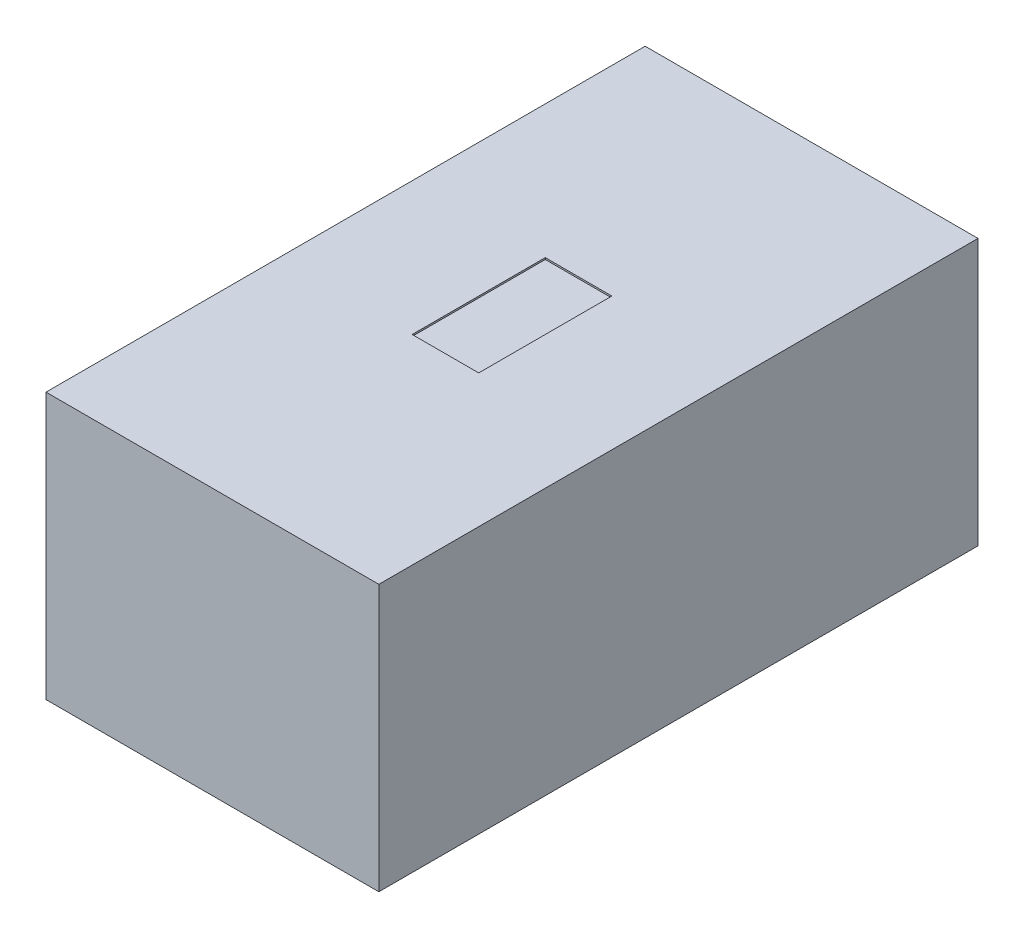
ISO-10303-21;
HEADER;
FILE_DESCRIPTION(('STEP AP214'),'2;1');
FILE_NAME('part.step','',(''),(''),'','','');
FILE_SCHEMA(('AUTOMOTIVE_DESIGN { 1 0 10303 214 1 1 1 1 }'));
ENDSEC;
DATA;
#1=APPLICATION_CONTEXT('core data for automotive mechanical design processes');
#2=APPLICATION_PROTOCOL_DEFINITION('international standard','automotive_design',2000,#1);
#3=PRODUCT_CONTEXT('',#1,'mechanical');
#4=PRODUCT('Part','Part','',(#3));
#5=PRODUCT_RELATED_PRODUCT_CATEGORY('part','',(#4));
#6=PRODUCT_DEFINITION_FORMATION('','',#4);
#7=PRODUCT_DEFINITION_CONTEXT('part definition',#1,'design');
#8=PRODUCT_DEFINITION('design','',#6,#7);
#9=PRODUCT_DEFINITION_SHAPE('','',#8);
#10=(LENGTH_UNIT() NAMED_UNIT(*) SI_UNIT(.MILLI.,.METRE.));
#11=(NAMED_UNIT(*) PLANE_ANGLE_UNIT() SI_UNIT($,.RADIAN.));
#12=(NAMED_UNIT(*) SI_UNIT($,.STERADIAN.) SOLID_ANGLE_UNIT());
#13=UNCERTAINTY_MEASURE_WITH_UNIT(LENGTH_MEASURE(1.E-05),#10,'distance_accuracy_value','');
#14=(GEOMETRIC_REPRESENTATION_CONTEXT(3) GLOBAL_UNCERTAINTY_ASSIGNED_CONTEXT((#13)) GLOBAL_UNIT_ASSIGNED_CONTEXT((#10,
#11,#12)) REPRESENTATION_CONTEXT('',''));
#15=CARTESIAN_POINT('',(0.,0.,0.));
#16=DIRECTION('',(0.,0.,1.));
#17=DIRECTION('',(1.,0.,0.));
#18=AXIS2_PLACEMENT_3D('',#15,#16,#17);
#19=CARTESIAN_POINT('',(0.5,0.8,-0.9));
#20=DIRECTION('',(-1.,0.,0.));
#21=DIRECTION('',(0.,0.,1.));
#22=AXIS2_PLACEMENT_3D('',#19,#20,#21);
#23=PLANE('',#22);
#24=DIRECTION('',(0.,0.,-1.));
#25=VECTOR('',#24,1.);
#26=CARTESIAN_POINT('',(0.5,0.,-0.9));
#27=LINE('',#26,#25);
#28=CARTESIAN_POINT('',(0.5,0.,0.9));
#29=VERTEX_POINT('',#28);
#30=CARTESIAN_POINT('',(0.5,0.,-0.9));
#31=VERTEX_POINT('',#30);
#32=EDGE_CURVE('E140',#29,#31,#27,.T.);
#33=ORIENTED_EDGE('',*,*,#32,.T.);
#34=DIRECTION('',(0.,-1.,0.));
#35=VECTOR('',#34,1.);
#36=CARTESIAN_POINT('',(0.5,0.8,-0.9));
#37=LINE('',#36,#35);
#38=CARTESIAN_POINT('',(0.5,0.8,-0.9));
#39=VERTEX_POINT('',#38);
#40=EDGE_CURVE('E11',#39,#31,#37,.T.);
#41=ORIENTED_EDGE('',*,*,#40,.F.);
#42=DIRECTION('',(0.,0.,-1.));
#43=VECTOR('',#42,1.);
#44=CARTESIAN_POINT('',(0.5,0.8,-0.9));
#45=LINE('',#44,#43);
#46=CARTESIAN_POINT('',(0.5,0.8,0.9));
#47=VERTEX_POINT('',#46);
#48=EDGE_CURVE('E144',#47,#39,#45,.T.);
#49=ORIENTED_EDGE('',*,*,#48,.F.);
#50=DIRECTION('',(0.,-1.,0.));
#51=VECTOR('',#50,1.);
#52=CARTESIAN_POINT('',(0.5,0.8,0.9));
#53=LINE('',#52,#51);
#54=EDGE_CURVE('E150',#47,#29,#53,.T.);
#55=ORIENTED_EDGE('',*,*,#54,.T.);
#56=EDGE_LOOP('',(#33,#41,#49,#55));
#57=FACE_BOUND('',#56,.T.);
#58=ADVANCED_FACE('F32',(#57),#23,.F.);
#59=CARTESIAN_POINT('',(-0.5,0.8,-0.9));
#60=DIRECTION('',(0.,0.,1.));
#61=DIRECTION('',(1.,0.,0.));
#62=AXIS2_PLACEMENT_3D('',#59,#60,#61);
#63=PLANE('',#62);
#64=DIRECTION('',(-1.,0.,0.));
#65=VECTOR('',#64,1.);
#66=CARTESIAN_POINT('',(-0.5,0.,-0.9));
#67=LINE('',#66,#65);
#68=CARTESIAN_POINT('',(-0.5,0.,-0.9));
#69=VERTEX_POINT('',#68);
#70=EDGE_CURVE('E153',#31,#69,#67,.T.);
#71=ORIENTED_EDGE('',*,*,#70,.T.);
#72=DIRECTION('',(0.,-1.,0.));
#73=VECTOR('',#72,1.);
#74=CARTESIAN_POINT('',(-0.5,0.8,-0.9));
#75=LINE('',#74,#73);
#76=CARTESIAN_POINT('',(-0.5,0.8,-0.9));
#77=VERTEX_POINT('',#76);
#78=EDGE_CURVE('E39',#77,#69,#75,.T.);
#79=ORIENTED_EDGE('',*,*,#78,.F.);
#80=DIRECTION('',(-1.,0.,0.));
#81=VECTOR('',#80,1.);
#82=CARTESIAN_POINT('',(-0.5,0.8,-0.9));
#83=LINE('',#82,#81);
#84=EDGE_CURVE('E83',#39,#77,#83,.T.);
#85=ORIENTED_EDGE('',*,*,#84,.F.);
#86=ORIENTED_EDGE('',*,*,#40,.T.);
#87=EDGE_LOOP('',(#71,#79,#85,#86));
#88=FACE_BOUND('',#87,.T.);
#89=ADVANCED_FACE('F182',(#88),#63,.F.);
#90=CARTESIAN_POINT('',(-0.5,0.8,-0.9));
#91=DIRECTION('',(1.,0.,0.));
#92=DIRECTION('',(0.,0.,-1.));
#93=AXIS2_PLACEMENT_3D('',#90,#91,#92);
#94=PLANE('',#93);
#95=DIRECTION('',(0.,0.,1.));
#96=VECTOR('',#95,1.);
#97=CARTESIAN_POINT('',(-0.5,0.,-0.9));
#98=LINE('',#97,#96);
#99=CARTESIAN_POINT('',(-0.5,0.,0.9));
#100=VERTEX_POINT('',#99);
#101=EDGE_CURVE('E155',#69,#100,#98,.T.);
#102=ORIENTED_EDGE('',*,*,#101,.T.);
#103=DIRECTION('',(0.,-1.,0.));
#104=VECTOR('',#103,1.);
#105=CARTESIAN_POINT('',(-0.5,0.8,0.9));
#106=LINE('',#105,#104);
#107=CARTESIAN_POINT('',(-0.5,0.8,0.9));
#108=VERTEX_POINT('',#107);
#109=EDGE_CURVE('E159',#108,#100,#106,.T.);
#110=ORIENTED_EDGE('',*,*,#109,.F.);
#111=DIRECTION('',(0.,0.,1.));
#112=VECTOR('',#111,1.);
#113=CARTESIAN_POINT('',(-0.5,0.8,-0.9));
#114=LINE('',#113,#112);
#115=EDGE_CURVE('E147',#77,#108,#114,.T.);
#116=ORIENTED_EDGE('',*,*,#115,.F.);
#117=ORIENTED_EDGE('',*,*,#78,.T.);
#118=EDGE_LOOP('',(#102,#110,#116,#117));
#119=FACE_BOUND('',#118,.T.);
#120=ADVANCED_FACE('F164',(#119),#94,.F.);
#121=CARTESIAN_POINT('',(-0.5,0.8,0.9));
#122=DIRECTION('',(0.,0.,-1.));
#123=DIRECTION('',(-1.,0.,0.));
#124=AXIS2_PLACEMENT_3D('',#121,#122,#123);
#125=PLANE('',#124);
#126=DIRECTION('',(1.,0.,0.));
#127=VECTOR('',#126,1.);
#128=CARTESIAN_POINT('',(-0.5,0.,0.9));
#129=LINE('',#128,#127);
#130=EDGE_CURVE('E76',#100,#29,#129,.T.);
#131=ORIENTED_EDGE('',*,*,#130,.T.);
#132=ORIENTED_EDGE('',*,*,#54,.F.);
#133=DIRECTION('',(1.,0.,0.));
#134=VECTOR('',#133,1.);
#135=CARTESIAN_POINT('',(-0.5,0.8,0.9));
#136=LINE('',#135,#134);
#137=EDGE_CURVE('E55',#108,#47,#136,.T.);
#138=ORIENTED_EDGE('',*,*,#137,.F.);
#139=ORIENTED_EDGE('',*,*,#109,.T.);
#140=EDGE_LOOP('',(#131,#132,#138,#139));
#141=FACE_BOUND('',#140,.T.);
#142=ADVANCED_FACE('F172',(#141),#125,.F.);
#143=CARTESIAN_POINT('',(0.,0.8,0.));
#144=DIRECTION('',(0.,1.,0.));
#145=DIRECTION('',(0.,0.,1.));
#146=AXIS2_PLACEMENT_3D('',#143,#144,#145);
#147=PLANE('',#146);
#148=DIRECTION('',(0.,0.,-1.));
#149=VECTOR('',#148,1.);
#150=CARTESIAN_POINT('',(0.1,0.8,-0.2));
#151=LINE('',#150,#149);
#152=CARTESIAN_POINT('',(0.1,0.8,0.2));
#153=VERTEX_POINT('',#152);
#154=CARTESIAN_POINT('',(0.1,0.8,-0.2));
#155=VERTEX_POINT('',#154);
#156=EDGE_CURVE('E46',#153,#155,#151,.T.);
#157=ORIENTED_EDGE('',*,*,#156,.F.);
#158=DIRECTION('',(1.,0.,0.));
#159=VECTOR('',#158,1.);
#160=CARTESIAN_POINT('',(-0.1,0.8,0.2));
#161=LINE('',#160,#159);
#162=CARTESIAN_POINT('',(-0.1,0.8,0.2));
#163=VERTEX_POINT('',#162);
#164=EDGE_CURVE('E125',#163,#153,#161,.T.);
#165=ORIENTED_EDGE('',*,*,#164,.F.);
#166=DIRECTION('',(0.,0.,1.));
#167=VECTOR('',#166,1.);
#168=CARTESIAN_POINT('',(-0.1,0.8,-0.2));
#169=LINE('',#168,#167);
#170=CARTESIAN_POINT('',(-0.1,0.8,-0.2));
#171=VERTEX_POINT('',#170);
#172=EDGE_CURVE('E128',#171,#163,#169,.T.);
#173=ORIENTED_EDGE('',*,*,#172,.F.);
#174=DIRECTION('',(-1.,0.,0.));
#175=VECTOR('',#174,1.);
#176=CARTESIAN_POINT('',(-0.1,0.8,-0.2));
#177=LINE('',#176,#175);
#178=EDGE_CURVE('E134',#155,#171,#177,.T.);
#179=ORIENTED_EDGE('',*,*,#178,.F.);
#180=EDGE_LOOP('',(#157,#165,#173,#179));
#181=FACE_BOUND('',#180,.T.);
#182=ORIENTED_EDGE('',*,*,#48,.T.);
#183=ORIENTED_EDGE('',*,*,#84,.T.);
#184=ORIENTED_EDGE('',*,*,#115,.T.);
#185=ORIENTED_EDGE('',*,*,#137,.T.);
#186=EDGE_LOOP('',(#182,#183,#184,#185));
#187=FACE_BOUND('',#186,.T.);
#188=ADVANCED_FACE('F174',(#181,#187),#147,.T.);
#189=CARTESIAN_POINT('',(0.,0.,0.));
#190=DIRECTION('',(0.,1.,0.));
#191=DIRECTION('',(0.,0.,1.));
#192=AXIS2_PLACEMENT_3D('',#189,#190,#191);
#193=PLANE('',#192);
#194=ORIENTED_EDGE('',*,*,#32,.F.);
#195=ORIENTED_EDGE('',*,*,#130,.F.);
#196=ORIENTED_EDGE('',*,*,#101,.F.);
#197=ORIENTED_EDGE('',*,*,#70,.F.);
#198=EDGE_LOOP('',(#194,#195,#196,#197));
#199=FACE_BOUND('',#198,.T.);
#200=ADVANCED_FACE('F168',(#199),#193,.F.);
#201=CARTESIAN_POINT('',(0.1,0.795,-0.2));
#202=DIRECTION('',(1.,0.,0.));
#203=DIRECTION('',(0.,0.,-1.));
#204=AXIS2_PLACEMENT_3D('',#201,#202,#203);
#205=PLANE('',#204);
#206=ORIENTED_EDGE('',*,*,#156,.T.);
#207=DIRECTION('',(0.,1.,0.));
#208=VECTOR('',#207,1.);
#209=CARTESIAN_POINT('',(0.1,0.795,-0.2));
#210=LINE('',#209,#208);
#211=CARTESIAN_POINT('',(0.1,0.795,-0.2));
#212=VERTEX_POINT('',#211);
#213=EDGE_CURVE('E103',#212,#155,#210,.T.);
#214=ORIENTED_EDGE('',*,*,#213,.F.);
#215=DIRECTION('',(0.,0.,-1.));
#216=VECTOR('',#215,1.);
#217=CARTESIAN_POINT('',(0.1,0.795,-0.2));
#218=LINE('',#217,#216);
#219=CARTESIAN_POINT('',(0.1,0.795,0.2));
#220=VERTEX_POINT('',#219);
#221=EDGE_CURVE('E107',#220,#212,#218,.T.);
#222=ORIENTED_EDGE('',*,*,#221,.F.);
#223=DIRECTION('',(0.,1.,0.));
#224=VECTOR('',#223,1.);
#225=CARTESIAN_POINT('',(0.1,0.795,0.2));
#226=LINE('',#225,#224);
#227=EDGE_CURVE('E138',#220,#153,#226,.T.);
#228=ORIENTED_EDGE('',*,*,#227,.T.);
#229=EDGE_LOOP('',(#206,#214,#222,#228));
#230=FACE_BOUND('',#229,.T.);
#231=ADVANCED_FACE('F105',(#230),#205,.F.);
#232=CARTESIAN_POINT('',(-0.1,0.795,0.2));
#233=DIRECTION('',(0.,0.,1.));
#234=DIRECTION('',(1.,0.,0.));
#235=AXIS2_PLACEMENT_3D('',#232,#233,#234);
#236=PLANE('',#235);
#237=ORIENTED_EDGE('',*,*,#164,.T.);
#238=ORIENTED_EDGE('',*,*,#227,.F.);
#239=DIRECTION('',(1.,0.,0.));
#240=VECTOR('',#239,1.);
#241=CARTESIAN_POINT('',(-0.1,0.795,0.2));
#242=LINE('',#241,#240);
#243=CARTESIAN_POINT('',(-0.1,0.795,0.2));
#244=VERTEX_POINT('',#243);
#245=EDGE_CURVE('E113',#244,#220,#242,.T.);
#246=ORIENTED_EDGE('',*,*,#245,.F.);
#247=DIRECTION('',(0.,1.,0.));
#248=VECTOR('',#247,1.);
#249=CARTESIAN_POINT('',(-0.1,0.795,0.2));
#250=LINE('',#249,#248);
#251=EDGE_CURVE('E141',#244,#163,#250,.T.);
#252=ORIENTED_EDGE('',*,*,#251,.T.);
#253=EDGE_LOOP('',(#237,#238,#246,#252));
#254=FACE_BOUND('',#253,.T.);
#255=ADVANCED_FACE('F221',(#254),#236,.F.);
#256=CARTESIAN_POINT('',(-0.1,0.795,-0.2));
#257=DIRECTION('',(-1.,0.,0.));
#258=DIRECTION('',(0.,0.,1.));
#259=AXIS2_PLACEMENT_3D('',#256,#257,#258);
#260=PLANE('',#259);
#261=ORIENTED_EDGE('',*,*,#172,.T.);
#262=ORIENTED_EDGE('',*,*,#251,.F.);
#263=DIRECTION('',(0.,0.,1.));
#264=VECTOR('',#263,1.);
#265=CARTESIAN_POINT('',(-0.1,0.795,-0.2));
#266=LINE('',#265,#264);
#267=CARTESIAN_POINT('',(-0.1,0.795,-0.2));
#268=VERTEX_POINT('',#267);
#269=EDGE_CURVE('E121',#268,#244,#266,.T.);
#270=ORIENTED_EDGE('',*,*,#269,.F.);
#271=DIRECTION('',(0.,1.,0.));
#272=VECTOR('',#271,1.);
#273=CARTESIAN_POINT('',(-0.1,0.795,-0.2));
#274=LINE('',#273,#272);
#275=EDGE_CURVE('E112',#268,#171,#274,.T.);
#276=ORIENTED_EDGE('',*,*,#275,.T.);
#277=EDGE_LOOP('',(#261,#262,#270,#276));
#278=FACE_BOUND('',#277,.T.);
#279=ADVANCED_FACE('F230',(#278),#260,.F.);
#280=CARTESIAN_POINT('',(-0.1,0.795,-0.2));
#281=DIRECTION('',(0.,0.,-1.));
#282=DIRECTION('',(-1.,0.,0.));
#283=AXIS2_PLACEMENT_3D('',#280,#281,#282);
#284=PLANE('',#283);
#285=ORIENTED_EDGE('',*,*,#178,.T.);
#286=ORIENTED_EDGE('',*,*,#275,.F.);
#287=DIRECTION('',(-1.,0.,0.));
#288=VECTOR('',#287,1.);
#289=CARTESIAN_POINT('',(-0.1,0.795,-0.2));
#290=LINE('',#289,#288);
#291=EDGE_CURVE('E116',#212,#268,#290,.T.);
#292=ORIENTED_EDGE('',*,*,#291,.F.);
#293=ORIENTED_EDGE('',*,*,#213,.T.);
#294=EDGE_LOOP('',(#285,#286,#292,#293));
#295=FACE_BOUND('',#294,.T.);
#296=ADVANCED_FACE('F117',(#295),#284,.F.);
#297=CARTESIAN_POINT('',(0.,0.795,0.));
#298=DIRECTION('',(0.,1.,0.));
#299=DIRECTION('',(0.,0.,1.));
#300=AXIS2_PLACEMENT_3D('',#297,#298,#299);
#301=PLANE('',#300);
#302=ORIENTED_EDGE('',*,*,#221,.T.);
#303=ORIENTED_EDGE('',*,*,#291,.T.);
#304=ORIENTED_EDGE('',*,*,#269,.T.);
#305=ORIENTED_EDGE('',*,*,#245,.T.);
#306=EDGE_LOOP('',(#302,#303,#304,#305));
#307=FACE_BOUND('',#306,.T.);
#308=ADVANCED_FACE('F123',(#307),#301,.T.);
#309=CLOSED_SHELL('',(#58,#89,#120,#142,#188,#200,#231,#255,#279,#296,#308));
#310=MANIFOLD_SOLID_BREP('B2',#309);
#311=ADVANCED_BREP_SHAPE_REPRESENTATION('',(#18,#310),#14);
#312=SHAPE_DEFINITION_REPRESENTATION(#9,#311);
ENDSEC;
END-ISO-10303-21;
